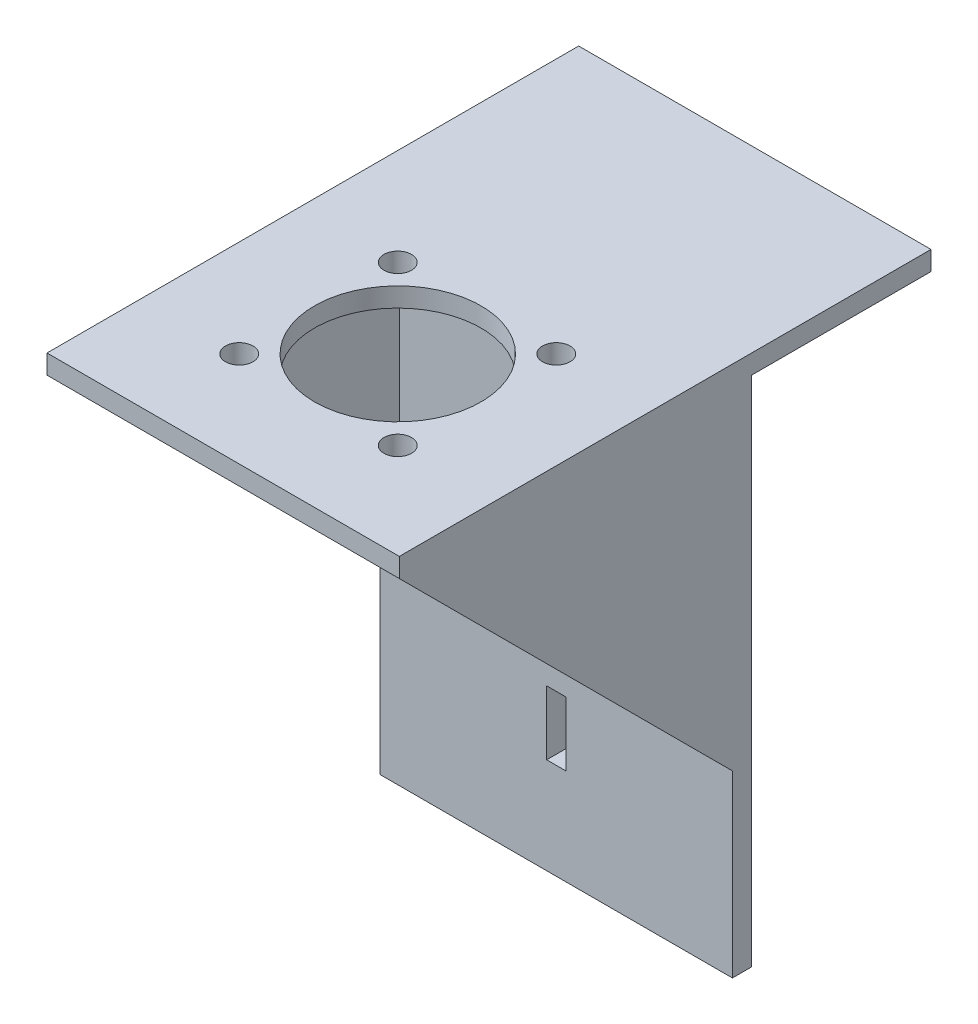
ISO-10303-21;
HEADER;
FILE_DESCRIPTION(('STEP AP214'),'2;1');
FILE_NAME('part.step','',(''),(''),'','','');
FILE_SCHEMA(('AUTOMOTIVE_DESIGN { 1 0 10303 214 1 1 1 1 }'));
ENDSEC;
DATA;
#1=APPLICATION_CONTEXT('core data for automotive mechanical design processes');
#2=APPLICATION_PROTOCOL_DEFINITION('international standard','automotive_design',2000,#1);
#3=PRODUCT_CONTEXT('',#1,'mechanical');
#4=PRODUCT('Part','Part','',(#3));
#5=PRODUCT_RELATED_PRODUCT_CATEGORY('part','',(#4));
#6=PRODUCT_DEFINITION_FORMATION('','',#4);
#7=PRODUCT_DEFINITION_CONTEXT('part definition',#1,'design');
#8=PRODUCT_DEFINITION('design','',#6,#7);
#9=PRODUCT_DEFINITION_SHAPE('','',#8);
#10=(LENGTH_UNIT() NAMED_UNIT(*) SI_UNIT(.MILLI.,.METRE.));
#11=(NAMED_UNIT(*) PLANE_ANGLE_UNIT() SI_UNIT($,.RADIAN.));
#12=(NAMED_UNIT(*) SI_UNIT($,.STERADIAN.) SOLID_ANGLE_UNIT());
#13=UNCERTAINTY_MEASURE_WITH_UNIT(LENGTH_MEASURE(1.E-05),#10,'distance_accuracy_value','');
#14=(GEOMETRIC_REPRESENTATION_CONTEXT(3) GLOBAL_UNCERTAINTY_ASSIGNED_CONTEXT((#13)) GLOBAL_UNIT_ASSIGNED_CONTEXT((#10,
#11,#12)) REPRESENTATION_CONTEXT('',''));
#15=CARTESIAN_POINT('',(0.,0.,0.));
#16=DIRECTION('',(0.,0.,1.));
#17=DIRECTION('',(1.,0.,0.));
#18=AXIS2_PLACEMENT_3D('',#15,#16,#17);
#19=CARTESIAN_POINT('',(-27.5,3.,-40.));
#20=DIRECTION('',(1.,0.,0.));
#21=DIRECTION('',(0.,0.,-1.));
#22=AXIS2_PLACEMENT_3D('',#19,#20,#21);
#23=PLANE('',#22);
#24=DIRECTION('',(0.,0.707106781186548,0.707106781186548));
#25=VECTOR('',#24,1.);
#26=CARTESIAN_POINT('',(-27.5,0.,40.));
#27=LINE('',#26,#25);
#28=CARTESIAN_POINT('',(-27.5,-52.,-12.));
#29=VERTEX_POINT('',#28);
#30=CARTESIAN_POINT('',(-27.5,0.,40.));
#31=VERTEX_POINT('',#30);
#32=EDGE_CURVE('E147',#29,#31,#27,.T.);
#33=ORIENTED_EDGE('',*,*,#32,.T.);
#34=DIRECTION('',(0.,-1.,0.));
#35=VECTOR('',#34,1.);
#36=CARTESIAN_POINT('',(-27.5,3.,40.));
#37=LINE('',#36,#35);
#38=CARTESIAN_POINT('',(-27.5,3.,40.));
#39=VERTEX_POINT('',#38);
#40=EDGE_CURVE('E252',#39,#31,#37,.T.);
#41=ORIENTED_EDGE('',*,*,#40,.F.);
#42=DIRECTION('',(0.,0.,1.));
#43=VECTOR('',#42,1.);
#44=CARTESIAN_POINT('',(-27.5,3.,-40.));
#45=LINE('',#44,#43);
#46=CARTESIAN_POINT('',(-27.5,3.,-43.));
#47=VERTEX_POINT('',#46);
#48=EDGE_CURVE('E322',#47,#39,#45,.T.);
#49=ORIENTED_EDGE('',*,*,#48,.F.);
#50=DIRECTION('',(0.,1.,0.));
#51=VECTOR('',#50,1.);
#52=CARTESIAN_POINT('',(-27.5,3.,-43.));
#53=LINE('',#52,#51);
#54=CARTESIAN_POINT('',(-27.5,0.,-43.));
#55=VERTEX_POINT('',#54);
#56=EDGE_CURVE('E184',#55,#47,#53,.T.);
#57=ORIENTED_EDGE('',*,*,#56,.F.);
#58=DIRECTION('',(0.,0.,1.));
#59=VECTOR('',#58,1.);
#60=CARTESIAN_POINT('',(-27.5,0.,-40.));
#61=LINE('',#60,#59);
#62=CARTESIAN_POINT('',(-27.5,0.,-15.));
#63=VERTEX_POINT('',#62);
#64=EDGE_CURVE('E313',#55,#63,#61,.T.);
#65=ORIENTED_EDGE('',*,*,#64,.T.);
#66=DIRECTION('',(0.,1.,0.));
#67=VECTOR('',#66,1.);
#68=CARTESIAN_POINT('',(-27.5,-80.,-15.));
#69=LINE('',#68,#67);
#70=CARTESIAN_POINT('',(-27.5,-80.,-15.));
#71=VERTEX_POINT('',#70);
#72=EDGE_CURVE('E233',#71,#63,#69,.T.);
#73=ORIENTED_EDGE('',*,*,#72,.F.);
#74=DIRECTION('',(0.,0.,-1.));
#75=VECTOR('',#74,1.);
#76=CARTESIAN_POINT('',(-27.5,-80.,-15.));
#77=LINE('',#76,#75);
#78=CARTESIAN_POINT('',(-27.5,-80.,-12.));
#79=VERTEX_POINT('',#78);
#80=EDGE_CURVE('E210',#79,#71,#77,.T.);
#81=ORIENTED_EDGE('',*,*,#80,.F.);
#82=DIRECTION('',(0.,1.,0.));
#83=VECTOR('',#82,1.);
#84=CARTESIAN_POINT('',(-27.5,-80.,-12.));
#85=LINE('',#84,#83);
#86=EDGE_CURVE('E219',#79,#29,#85,.T.);
#87=ORIENTED_EDGE('',*,*,#86,.T.);
#88=EDGE_LOOP('',(#33,#41,#49,#57,#65,#73,#81,#87));
#89=FACE_BOUND('',#88,.T.);
#90=ADVANCED_FACE('F33',(#89),#23,.F.);
#91=CARTESIAN_POINT('',(27.5,3.,-40.));
#92=DIRECTION('',(-1.,0.,0.));
#93=DIRECTION('',(0.,0.,1.));
#94=AXIS2_PLACEMENT_3D('',#91,#92,#93);
#95=PLANE('',#94);
#96=DIRECTION('',(0.,0.,-1.));
#97=VECTOR('',#96,1.);
#98=CARTESIAN_POINT('',(27.5,0.,-40.));
#99=LINE('',#98,#97);
#100=CARTESIAN_POINT('',(27.5,0.,-15.));
#101=VERTEX_POINT('',#100);
#102=CARTESIAN_POINT('',(27.5,0.,-43.));
#103=VERTEX_POINT('',#102);
#104=EDGE_CURVE('E227',#101,#103,#99,.T.);
#105=ORIENTED_EDGE('',*,*,#104,.T.);
#106=DIRECTION('',(0.,-1.,0.));
#107=VECTOR('',#106,1.);
#108=CARTESIAN_POINT('',(27.5,3.,-43.));
#109=LINE('',#108,#107);
#110=CARTESIAN_POINT('',(27.5,3.,-43.));
#111=VERTEX_POINT('',#110);
#112=EDGE_CURVE('E181',#111,#103,#109,.T.);
#113=ORIENTED_EDGE('',*,*,#112,.F.);
#114=DIRECTION('',(0.,0.,-1.));
#115=VECTOR('',#114,1.);
#116=CARTESIAN_POINT('',(27.5,3.,-40.));
#117=LINE('',#116,#115);
#118=CARTESIAN_POINT('',(27.5,3.,40.));
#119=VERTEX_POINT('',#118);
#120=EDGE_CURVE('E311',#119,#111,#117,.T.);
#121=ORIENTED_EDGE('',*,*,#120,.F.);
#122=DIRECTION('',(0.,-1.,0.));
#123=VECTOR('',#122,1.);
#124=CARTESIAN_POINT('',(27.5,3.,40.));
#125=LINE('',#124,#123);
#126=CARTESIAN_POINT('',(27.5,0.,40.));
#127=VERTEX_POINT('',#126);
#128=EDGE_CURVE('E308',#119,#127,#125,.T.);
#129=ORIENTED_EDGE('',*,*,#128,.T.);
#130=DIRECTION('',(0.,-0.707106781186548,-0.707106781186548));
#131=VECTOR('',#130,1.);
#132=CARTESIAN_POINT('',(27.5,-52.,-12.));
#133=LINE('',#132,#131);
#134=CARTESIAN_POINT('',(27.5,-52.,-12.));
#135=VERTEX_POINT('',#134);
#136=EDGE_CURVE('E151',#127,#135,#133,.T.);
#137=ORIENTED_EDGE('',*,*,#136,.T.);
#138=DIRECTION('',(0.,1.,0.));
#139=VECTOR('',#138,1.);
#140=CARTESIAN_POINT('',(27.5,-80.,-12.));
#141=LINE('',#140,#139);
#142=CARTESIAN_POINT('',(27.5,-80.,-12.));
#143=VERTEX_POINT('',#142);
#144=EDGE_CURVE('E234',#143,#135,#141,.T.);
#145=ORIENTED_EDGE('',*,*,#144,.F.);
#146=DIRECTION('',(0.,0.,1.));
#147=VECTOR('',#146,1.);
#148=CARTESIAN_POINT('',(27.5,-80.,-15.));
#149=LINE('',#148,#147);
#150=CARTESIAN_POINT('',(27.5,-80.,-15.));
#151=VERTEX_POINT('',#150);
#152=EDGE_CURVE('E215',#151,#143,#149,.T.);
#153=ORIENTED_EDGE('',*,*,#152,.F.);
#154=DIRECTION('',(0.,1.,0.));
#155=VECTOR('',#154,1.);
#156=CARTESIAN_POINT('',(27.5,-80.,-15.));
#157=LINE('',#156,#155);
#158=EDGE_CURVE('E230',#151,#101,#157,.T.);
#159=ORIENTED_EDGE('',*,*,#158,.T.);
#160=EDGE_LOOP('',(#105,#113,#121,#129,#137,#145,#153,#159));
#161=FACE_BOUND('',#160,.T.);
#162=ADVANCED_FACE('F290',(#161),#95,.F.);
#163=CARTESIAN_POINT('',(0.,0.,-43.));
#164=DIRECTION('',(0.,0.,-1.));
#165=DIRECTION('',(-1.,0.,0.));
#166=AXIS2_PLACEMENT_3D('',#163,#164,#165);
#167=PLANE('',#166);
#168=ORIENTED_EDGE('',*,*,#112,.T.);
#169=DIRECTION('',(1.,0.,0.));
#170=VECTOR('',#169,1.);
#171=CARTESIAN_POINT('',(27.5,0.,-43.));
#172=LINE('',#171,#170);
#173=EDGE_CURVE('E177',#55,#103,#172,.T.);
#174=ORIENTED_EDGE('',*,*,#173,.F.);
#175=ORIENTED_EDGE('',*,*,#56,.T.);
#176=DIRECTION('',(1.,0.,0.));
#177=VECTOR('',#176,1.);
#178=CARTESIAN_POINT('',(27.5,3.,-43.));
#179=LINE('',#178,#177);
#180=EDGE_CURVE('E186',#47,#111,#179,.T.);
#181=ORIENTED_EDGE('',*,*,#180,.T.);
#182=EDGE_LOOP('',(#168,#174,#175,#181));
#183=FACE_BOUND('',#182,.T.);
#184=ADVANCED_FACE('F296',(#183),#167,.T.);
#185=CARTESIAN_POINT('',(0.,0.,0.));
#186=DIRECTION('',(0.,1.,0.));
#187=DIRECTION('',(0.,0.,1.));
#188=AXIS2_PLACEMENT_3D('',#185,#186,#187);
#189=PLANE('',#188);
#190=CARTESIAN_POINT('',(-12.3743686707644,0.,0.369562995436836));
#191=DIRECTION('',(0.,1.,0.));
#192=DIRECTION('',(0.,0.,1.));
#193=AXIS2_PLACEMENT_3D('',#190,#191,#192);
#194=CIRCLE('',#193,2.15);
#195=CARTESIAN_POINT('',(-12.3743686707644,0.,2.51956299543684));
#196=VERTEX_POINT('',#195);
#197=EDGE_CURVE('E239',#196,#196,#194,.T.);
#198=ORIENTED_EDGE('',*,*,#197,.T.);
#199=EDGE_LOOP('',(#198));
#200=FACE_BOUND('',#199,.T.);
#201=CARTESIAN_POINT('',(12.3743686707652,0.,25.1183003369655));
#202=DIRECTION('',(0.,1.,0.));
#203=DIRECTION('',(0.,0.,1.));
#204=AXIS2_PLACEMENT_3D('',#201,#202,#203);
#205=CIRCLE('',#204,2.15);
#206=CARTESIAN_POINT('',(12.3743686707652,0.,27.2683003369655));
#207=VERTEX_POINT('',#206);
#208=EDGE_CURVE('E340',#207,#207,#205,.T.);
#209=ORIENTED_EDGE('',*,*,#208,.T.);
#210=EDGE_LOOP('',(#209));
#211=FACE_BOUND('',#210,.T.);
#212=CARTESIAN_POINT('',(0.,0.,12.7439316662008));
#213=DIRECTION('',(0.,1.,0.));
#214=DIRECTION('',(0.,0.,1.));
#215=AXIS2_PLACEMENT_3D('',#212,#213,#214);
#216=CIRCLE('',#215,13.);
#217=CARTESIAN_POINT('',(0.,0.,25.7439316662008));
#218=VERTEX_POINT('',#217);
#219=EDGE_CURVE('E328',#218,#218,#216,.T.);
#220=ORIENTED_EDGE('',*,*,#219,.T.);
#221=EDGE_LOOP('',(#220));
#222=FACE_BOUND('',#221,.T.);
#223=CARTESIAN_POINT('',(12.3743686707646,0.,0.369562995436263));
#224=DIRECTION('',(0.,1.,0.));
#225=DIRECTION('',(0.,0.,1.));
#226=AXIS2_PLACEMENT_3D('',#223,#224,#225);
#227=CIRCLE('',#226,2.15);
#228=CARTESIAN_POINT('',(12.3743686707646,0.,2.51956299543626));
#229=VERTEX_POINT('',#228);
#230=EDGE_CURVE('E334',#229,#229,#227,.T.);
#231=ORIENTED_EDGE('',*,*,#230,.T.);
#232=EDGE_LOOP('',(#231));
#233=FACE_BOUND('',#232,.T.);
#234=CARTESIAN_POINT('',(-12.374368670764,0.,25.118300336966));
#235=DIRECTION('',(0.,1.,0.));
#236=DIRECTION('',(0.,0.,1.));
#237=AXIS2_PLACEMENT_3D('',#234,#235,#236);
#238=CIRCLE('',#237,2.15);
#239=CARTESIAN_POINT('',(-12.374368670764,0.,27.268300336966));
#240=VERTEX_POINT('',#239);
#241=EDGE_CURVE('E346',#240,#240,#238,.T.);
#242=ORIENTED_EDGE('',*,*,#241,.T.);
#243=EDGE_LOOP('',(#242));
#244=FACE_BOUND('',#243,.T.);
#245=DIRECTION('',(1.,0.,0.));
#246=VECTOR('',#245,1.);
#247=CARTESIAN_POINT('',(-27.5,0.,40.));
#248=LINE('',#247,#246);
#249=CARTESIAN_POINT('',(-24.5,0.,40.));
#250=VERTEX_POINT('',#249);
#251=CARTESIAN_POINT('',(24.5,0.,40.));
#252=VERTEX_POINT('',#251);
#253=EDGE_CURVE('E49',#250,#252,#248,.T.);
#254=ORIENTED_EDGE('',*,*,#253,.F.);
#255=DIRECTION('',(0.,0.,-1.));
#256=VECTOR('',#255,1.);
#257=CARTESIAN_POINT('',(-24.5,0.,-12.));
#258=LINE('',#257,#256);
#259=CARTESIAN_POINT('',(-24.5,0.,-12.));
#260=VERTEX_POINT('',#259);
#261=EDGE_CURVE('E152',#250,#260,#258,.T.);
#262=ORIENTED_EDGE('',*,*,#261,.T.);
#263=DIRECTION('',(-1.,0.,0.));
#264=VECTOR('',#263,1.);
#265=CARTESIAN_POINT('',(-27.5,0.,-12.));
#266=LINE('',#265,#264);
#267=CARTESIAN_POINT('',(24.5,0.,-12.));
#268=VERTEX_POINT('',#267);
#269=EDGE_CURVE('E36',#268,#260,#266,.T.);
#270=ORIENTED_EDGE('',*,*,#269,.F.);
#271=DIRECTION('',(0.,0.,1.));
#272=VECTOR('',#271,1.);
#273=CARTESIAN_POINT('',(24.5,0.,40.));
#274=LINE('',#273,#272);
#275=EDGE_CURVE('E171',#268,#252,#274,.T.);
#276=ORIENTED_EDGE('',*,*,#275,.T.);
#277=EDGE_LOOP('',(#254,#262,#270,#276));
#278=FACE_BOUND('',#277,.T.);
#279=ADVANCED_FACE('F370',(#200,#211,#222,#233,#244,#278),#189,.F.);
#280=DIRECTION('',(1.,0.,0.));
#281=VECTOR('',#280,1.);
#282=CARTESIAN_POINT('',(-27.5,0.,-15.));
#283=LINE('',#282,#281);
#284=EDGE_CURVE('E203',#63,#101,#283,.T.);
#285=ORIENTED_EDGE('',*,*,#284,.F.);
#286=ORIENTED_EDGE('',*,*,#64,.F.);
#287=ORIENTED_EDGE('',*,*,#173,.T.);
#288=ORIENTED_EDGE('',*,*,#104,.F.);
#289=EDGE_LOOP('',(#285,#286,#287,#288));
#290=FACE_BOUND('',#289,.T.);
#291=ADVANCED_FACE('F361',(#290),#189,.F.);
#292=CARTESIAN_POINT('',(0.,3.,0.));
#293=DIRECTION('',(0.,1.,0.));
#294=DIRECTION('',(0.,0.,1.));
#295=AXIS2_PLACEMENT_3D('',#292,#293,#294);
#296=PLANE('',#295);
#297=CARTESIAN_POINT('',(-12.374368670764,3.,25.118300336966));
#298=DIRECTION('',(0.,1.,0.));
#299=DIRECTION('',(0.,0.,1.));
#300=AXIS2_PLACEMENT_3D('',#297,#298,#299);
#301=CIRCLE('',#300,2.15);
#302=CARTESIAN_POINT('',(-12.374368670764,3.,27.268300336966));
#303=VERTEX_POINT('',#302);
#304=EDGE_CURVE('E343',#303,#303,#301,.T.);
#305=ORIENTED_EDGE('',*,*,#304,.F.);
#306=EDGE_LOOP('',(#305));
#307=FACE_BOUND('',#306,.T.);
#308=CARTESIAN_POINT('',(12.3743686707646,3.,0.369562995436263));
#309=DIRECTION('',(0.,1.,0.));
#310=DIRECTION('',(0.,0.,1.));
#311=AXIS2_PLACEMENT_3D('',#308,#309,#310);
#312=CIRCLE('',#311,2.15);
#313=CARTESIAN_POINT('',(12.3743686707646,3.,2.51956299543626));
#314=VERTEX_POINT('',#313);
#315=EDGE_CURVE('E331',#314,#314,#312,.T.);
#316=ORIENTED_EDGE('',*,*,#315,.F.);
#317=EDGE_LOOP('',(#316));
#318=FACE_BOUND('',#317,.T.);
#319=ORIENTED_EDGE('',*,*,#48,.T.);
#320=DIRECTION('',(1.,0.,0.));
#321=VECTOR('',#320,1.);
#322=CARTESIAN_POINT('',(-27.5,3.,40.));
#323=LINE('',#322,#321);
#324=EDGE_CURVE('E306',#39,#119,#323,.T.);
#325=ORIENTED_EDGE('',*,*,#324,.T.);
#326=ORIENTED_EDGE('',*,*,#120,.T.);
#327=ORIENTED_EDGE('',*,*,#180,.F.);
#328=EDGE_LOOP('',(#319,#325,#326,#327));
#329=FACE_BOUND('',#328,.T.);
#330=CARTESIAN_POINT('',(0.,3.,12.7439316662008));
#331=DIRECTION('',(0.,1.,0.));
#332=DIRECTION('',(0.,0.,1.));
#333=AXIS2_PLACEMENT_3D('',#330,#331,#332);
#334=CIRCLE('',#333,13.);
#335=CARTESIAN_POINT('',(0.,3.,25.7439316662008));
#336=VERTEX_POINT('',#335);
#337=EDGE_CURVE('E316',#336,#336,#334,.T.);
#338=ORIENTED_EDGE('',*,*,#337,.F.);
#339=EDGE_LOOP('',(#338));
#340=FACE_BOUND('',#339,.T.);
#341=CARTESIAN_POINT('',(12.3743686707652,3.,25.1183003369655));
#342=DIRECTION('',(0.,1.,0.));
#343=DIRECTION('',(0.,0.,1.));
#344=AXIS2_PLACEMENT_3D('',#341,#342,#343);
#345=CIRCLE('',#344,2.15);
#346=CARTESIAN_POINT('',(12.3743686707652,3.,27.2683003369655));
#347=VERTEX_POINT('',#346);
#348=EDGE_CURVE('E337',#347,#347,#345,.T.);
#349=ORIENTED_EDGE('',*,*,#348,.F.);
#350=EDGE_LOOP('',(#349));
#351=FACE_BOUND('',#350,.T.);
#352=CARTESIAN_POINT('',(-12.3743686707644,3.,0.369562995436836));
#353=DIRECTION('',(0.,1.,0.));
#354=DIRECTION('',(0.,0.,1.));
#355=AXIS2_PLACEMENT_3D('',#352,#353,#354);
#356=CIRCLE('',#355,2.15);
#357=CARTESIAN_POINT('',(-12.3743686707644,3.,2.51956299543684));
#358=VERTEX_POINT('',#357);
#359=EDGE_CURVE('E349',#358,#358,#356,.T.);
#360=ORIENTED_EDGE('',*,*,#359,.F.);
#361=EDGE_LOOP('',(#360));
#362=FACE_BOUND('',#361,.T.);
#363=ADVANCED_FACE('F359',(#307,#318,#329,#340,#351,#362),#296,.T.);
#364=CARTESIAN_POINT('',(-27.5,3.,40.));
#365=DIRECTION('',(0.,0.,-1.));
#366=DIRECTION('',(-1.,0.,0.));
#367=AXIS2_PLACEMENT_3D('',#364,#365,#366);
#368=PLANE('',#367);
#369=EDGE_CURVE('E304',#31,#250,#248,.T.);
#370=ORIENTED_EDGE('',*,*,#369,.T.);
#371=ORIENTED_EDGE('',*,*,#253,.T.);
#372=DIRECTION('',(1.,0.,0.));
#373=VECTOR('',#372,1.);
#374=CARTESIAN_POINT('',(24.5,0.,40.));
#375=LINE('',#374,#373);
#376=EDGE_CURVE('E175',#252,#127,#375,.T.);
#377=ORIENTED_EDGE('',*,*,#376,.T.);
#378=ORIENTED_EDGE('',*,*,#128,.F.);
#379=ORIENTED_EDGE('',*,*,#324,.F.);
#380=ORIENTED_EDGE('',*,*,#40,.T.);
#381=EDGE_LOOP('',(#370,#371,#377,#378,#379,#380));
#382=FACE_BOUND('',#381,.T.);
#383=ADVANCED_FACE('F303',(#382),#368,.F.);
#384=CARTESIAN_POINT('',(0.,3.,12.7439316662008));
#385=DIRECTION('',(0.,-1.,0.));
#386=DIRECTION('',(0.,0.,-1.));
#387=AXIS2_PLACEMENT_3D('',#384,#385,#386);
#388=CYLINDRICAL_SURFACE('',#387,13.);
#389=ORIENTED_EDGE('',*,*,#337,.T.);
#390=EDGE_LOOP('',(#389));
#391=FACE_BOUND('',#390,.T.);
#392=ORIENTED_EDGE('',*,*,#219,.F.);
#393=EDGE_LOOP('',(#392));
#394=FACE_BOUND('',#393,.T.);
#395=ADVANCED_FACE('F369',(#391,#394),#388,.F.);
#396=CARTESIAN_POINT('',(12.3743686707646,3.,0.369562995436263));
#397=DIRECTION('',(0.,-1.,0.));
#398=DIRECTION('',(0.,0.,-1.));
#399=AXIS2_PLACEMENT_3D('',#396,#397,#398);
#400=CYLINDRICAL_SURFACE('',#399,2.15);
#401=ORIENTED_EDGE('',*,*,#315,.T.);
#402=EDGE_LOOP('',(#401));
#403=FACE_BOUND('',#402,.T.);
#404=ORIENTED_EDGE('',*,*,#230,.F.);
#405=EDGE_LOOP('',(#404));
#406=FACE_BOUND('',#405,.T.);
#407=ADVANCED_FACE('F429',(#403,#406),#400,.F.);
#408=CARTESIAN_POINT('',(12.3743686707652,3.,25.1183003369655));
#409=DIRECTION('',(0.,-1.,0.));
#410=DIRECTION('',(0.,0.,-1.));
#411=AXIS2_PLACEMENT_3D('',#408,#409,#410);
#412=CYLINDRICAL_SURFACE('',#411,2.15);
#413=ORIENTED_EDGE('',*,*,#348,.T.);
#414=EDGE_LOOP('',(#413));
#415=FACE_BOUND('',#414,.T.);
#416=ORIENTED_EDGE('',*,*,#208,.F.);
#417=EDGE_LOOP('',(#416));
#418=FACE_BOUND('',#417,.T.);
#419=ADVANCED_FACE('F426',(#415,#418),#412,.F.);
#420=CARTESIAN_POINT('',(-12.374368670764,3.,25.118300336966));
#421=DIRECTION('',(0.,-1.,0.));
#422=DIRECTION('',(0.,0.,-1.));
#423=AXIS2_PLACEMENT_3D('',#420,#421,#422);
#424=CYLINDRICAL_SURFACE('',#423,2.15);
#425=ORIENTED_EDGE('',*,*,#304,.T.);
#426=EDGE_LOOP('',(#425));
#427=FACE_BOUND('',#426,.T.);
#428=ORIENTED_EDGE('',*,*,#241,.F.);
#429=EDGE_LOOP('',(#428));
#430=FACE_BOUND('',#429,.T.);
#431=ADVANCED_FACE('F423',(#427,#430),#424,.F.);
#432=CARTESIAN_POINT('',(-12.3743686707644,3.,0.369562995436836));
#433=DIRECTION('',(0.,-1.,0.));
#434=DIRECTION('',(0.,0.,-1.));
#435=AXIS2_PLACEMENT_3D('',#432,#433,#434);
#436=CYLINDRICAL_SURFACE('',#435,2.15);
#437=ORIENTED_EDGE('',*,*,#359,.T.);
#438=EDGE_LOOP('',(#437));
#439=FACE_BOUND('',#438,.T.);
#440=ORIENTED_EDGE('',*,*,#197,.F.);
#441=EDGE_LOOP('',(#440));
#442=FACE_BOUND('',#441,.T.);
#443=ADVANCED_FACE('F356',(#439,#442),#436,.F.);
#444=CARTESIAN_POINT('',(-27.5,-80.,-15.));
#445=DIRECTION('',(0.,0.,1.));
#446=DIRECTION('',(1.,0.,0.));
#447=AXIS2_PLACEMENT_3D('',#444,#445,#446);
#448=PLANE('',#447);
#449=DIRECTION('',(-1.,0.,0.));
#450=VECTOR('',#449,1.);
#451=CARTESIAN_POINT('',(1.50000000000001,-65.,-15.));
#452=LINE('',#451,#450);
#453=CARTESIAN_POINT('',(1.50000000000001,-65.,-15.));
#454=VERTEX_POINT('',#453);
#455=CARTESIAN_POINT('',(-1.49999999999999,-65.,-15.));
#456=VERTEX_POINT('',#455);
#457=EDGE_CURVE('E191',#454,#456,#452,.T.);
#458=ORIENTED_EDGE('',*,*,#457,.F.);
#459=DIRECTION('',(0.,-1.,0.));
#460=VECTOR('',#459,1.);
#461=CARTESIAN_POINT('',(1.50000000000001,-55.,-15.));
#462=LINE('',#461,#460);
#463=CARTESIAN_POINT('',(1.50000000000001,-55.,-15.));
#464=VERTEX_POINT('',#463);
#465=EDGE_CURVE('E189',#464,#454,#462,.T.);
#466=ORIENTED_EDGE('',*,*,#465,.F.);
#467=DIRECTION('',(1.,0.,0.));
#468=VECTOR('',#467,1.);
#469=CARTESIAN_POINT('',(1.50000000000001,-55.,-15.));
#470=LINE('',#469,#468);
#471=CARTESIAN_POINT('',(-1.49999999999999,-55.,-15.));
#472=VERTEX_POINT('',#471);
#473=EDGE_CURVE('E197',#472,#464,#470,.T.);
#474=ORIENTED_EDGE('',*,*,#473,.F.);
#475=DIRECTION('',(0.,1.,0.));
#476=VECTOR('',#475,1.);
#477=CARTESIAN_POINT('',(-1.49999999999999,-55.,-15.));
#478=LINE('',#477,#476);
#479=EDGE_CURVE('E194',#456,#472,#478,.T.);
#480=ORIENTED_EDGE('',*,*,#479,.F.);
#481=EDGE_LOOP('',(#458,#466,#474,#480));
#482=FACE_BOUND('',#481,.T.);
#483=ORIENTED_EDGE('',*,*,#284,.T.);
#484=ORIENTED_EDGE('',*,*,#158,.F.);
#485=DIRECTION('',(1.,0.,0.));
#486=VECTOR('',#485,1.);
#487=CARTESIAN_POINT('',(-27.5,-80.,-15.));
#488=LINE('',#487,#486);
#489=EDGE_CURVE('E213',#71,#151,#488,.T.);
#490=ORIENTED_EDGE('',*,*,#489,.F.);
#491=ORIENTED_EDGE('',*,*,#72,.T.);
#492=EDGE_LOOP('',(#483,#484,#490,#491));
#493=FACE_BOUND('',#492,.T.);
#494=ADVANCED_FACE('F269',(#482,#493),#448,.F.);
#495=CARTESIAN_POINT('',(-27.5,-80.,-12.));
#496=DIRECTION('',(0.,0.,-1.));
#497=DIRECTION('',(-1.,0.,0.));
#498=AXIS2_PLACEMENT_3D('',#495,#496,#497);
#499=PLANE('',#498);
#500=DIRECTION('',(1.,0.,0.));
#501=VECTOR('',#500,1.);
#502=CARTESIAN_POINT('',(-27.5,-55.,-12.));
#503=LINE('',#502,#501);
#504=CARTESIAN_POINT('',(-1.49999999999999,-55.,-12.));
#505=VERTEX_POINT('',#504);
#506=CARTESIAN_POINT('',(1.50000000000001,-55.,-12.));
#507=VERTEX_POINT('',#506);
#508=EDGE_CURVE('E42',#505,#507,#503,.T.);
#509=ORIENTED_EDGE('',*,*,#508,.T.);
#510=DIRECTION('',(0.,-1.,0.));
#511=VECTOR('',#510,1.);
#512=CARTESIAN_POINT('',(1.50000000000001,-80.,-12.));
#513=LINE('',#512,#511);
#514=CARTESIAN_POINT('',(1.50000000000001,-65.,-12.));
#515=VERTEX_POINT('',#514);
#516=EDGE_CURVE('E11',#507,#515,#513,.T.);
#517=ORIENTED_EDGE('',*,*,#516,.T.);
#518=DIRECTION('',(-1.,0.,0.));
#519=VECTOR('',#518,1.);
#520=CARTESIAN_POINT('',(-27.5,-65.,-12.));
#521=LINE('',#520,#519);
#522=CARTESIAN_POINT('',(-1.49999999999999,-65.,-12.));
#523=VERTEX_POINT('',#522);
#524=EDGE_CURVE('E248',#515,#523,#521,.T.);
#525=ORIENTED_EDGE('',*,*,#524,.T.);
#526=DIRECTION('',(0.,1.,0.));
#527=VECTOR('',#526,1.);
#528=CARTESIAN_POINT('',(-1.5,-80.,-12.));
#529=LINE('',#528,#527);
#530=EDGE_CURVE('E251',#523,#505,#529,.T.);
#531=ORIENTED_EDGE('',*,*,#530,.T.);
#532=EDGE_LOOP('',(#509,#517,#525,#531));
#533=FACE_BOUND('',#532,.T.);
#534=DIRECTION('',(0.,-1.,0.));
#535=VECTOR('',#534,1.);
#536=CARTESIAN_POINT('',(-24.5,-52.,-12.));
#537=LINE('',#536,#535);
#538=CARTESIAN_POINT('',(-24.5,-52.,-12.));
#539=VERTEX_POINT('',#538);
#540=EDGE_CURVE('E156',#260,#539,#537,.T.);
#541=ORIENTED_EDGE('',*,*,#540,.T.);
#542=DIRECTION('',(-1.,0.,0.));
#543=VECTOR('',#542,1.);
#544=CARTESIAN_POINT('',(-24.5,-52.,-12.));
#545=LINE('',#544,#543);
#546=EDGE_CURVE('E141',#539,#29,#545,.T.);
#547=ORIENTED_EDGE('',*,*,#546,.T.);
#548=ORIENTED_EDGE('',*,*,#86,.F.);
#549=DIRECTION('',(-1.,0.,0.));
#550=VECTOR('',#549,1.);
#551=CARTESIAN_POINT('',(-27.5,-80.,-12.));
#552=LINE('',#551,#550);
#553=EDGE_CURVE('E217',#143,#79,#552,.T.);
#554=ORIENTED_EDGE('',*,*,#553,.F.);
#555=ORIENTED_EDGE('',*,*,#144,.T.);
#556=DIRECTION('',(1.,0.,0.));
#557=VECTOR('',#556,1.);
#558=CARTESIAN_POINT('',(24.5,-52.,-12.));
#559=LINE('',#558,#557);
#560=CARTESIAN_POINT('',(24.5,-52.,-12.));
#561=VERTEX_POINT('',#560);
#562=EDGE_CURVE('E57',#561,#135,#559,.T.);
#563=ORIENTED_EDGE('',*,*,#562,.F.);
#564=DIRECTION('',(0.,1.,0.));
#565=VECTOR('',#564,1.);
#566=CARTESIAN_POINT('',(24.5,0.,-12.));
#567=LINE('',#566,#565);
#568=EDGE_CURVE('E169',#561,#268,#567,.T.);
#569=ORIENTED_EDGE('',*,*,#568,.T.);
#570=ORIENTED_EDGE('',*,*,#269,.T.);
#571=EDGE_LOOP('',(#541,#547,#548,#554,#555,#563,#569,#570));
#572=FACE_BOUND('',#571,.T.);
#573=ADVANCED_FACE('F160',(#533,#572),#499,.F.);
#574=CARTESIAN_POINT('',(0.,-80.,0.));
#575=DIRECTION('',(0.,1.,0.));
#576=DIRECTION('',(0.,0.,1.));
#577=AXIS2_PLACEMENT_3D('',#574,#575,#576);
#578=PLANE('',#577);
#579=ORIENTED_EDGE('',*,*,#80,.T.);
#580=ORIENTED_EDGE('',*,*,#489,.T.);
#581=ORIENTED_EDGE('',*,*,#152,.T.);
#582=ORIENTED_EDGE('',*,*,#553,.T.);
#583=EDGE_LOOP('',(#579,#580,#581,#582));
#584=FACE_BOUND('',#583,.T.);
#585=ADVANCED_FACE('F410',(#584),#578,.F.);
#586=CARTESIAN_POINT('',(1.50000000000001,-55.,65.));
#587=DIRECTION('',(1.,0.,0.));
#588=DIRECTION('',(0.,0.,-1.));
#589=AXIS2_PLACEMENT_3D('',#586,#587,#588);
#590=PLANE('',#589);
#591=DIRECTION('',(0.,0.,-1.));
#592=VECTOR('',#591,1.);
#593=CARTESIAN_POINT('',(1.50000000000001,-55.,65.));
#594=LINE('',#593,#592);
#595=EDGE_CURVE('E201',#507,#464,#594,.T.);
#596=ORIENTED_EDGE('',*,*,#595,.T.);
#597=ORIENTED_EDGE('',*,*,#465,.T.);
#598=DIRECTION('',(0.,0.,-1.));
#599=VECTOR('',#598,1.);
#600=CARTESIAN_POINT('',(1.50000000000001,-65.,65.));
#601=LINE('',#600,#599);
#602=EDGE_CURVE('E200',#515,#454,#601,.T.);
#603=ORIENTED_EDGE('',*,*,#602,.F.);
#604=ORIENTED_EDGE('',*,*,#516,.F.);
#605=EDGE_LOOP('',(#596,#597,#603,#604));
#606=FACE_BOUND('',#605,.T.);
#607=ADVANCED_FACE('F273',(#606),#590,.F.);
#608=CARTESIAN_POINT('',(1.50000000000001,-55.,65.));
#609=DIRECTION('',(0.,1.,0.));
#610=DIRECTION('',(0.,0.,1.));
#611=AXIS2_PLACEMENT_3D('',#608,#609,#610);
#612=PLANE('',#611);
#613=DIRECTION('',(0.,0.,-1.));
#614=VECTOR('',#613,1.);
#615=CARTESIAN_POINT('',(-1.49999999999999,-55.,65.));
#616=LINE('',#615,#614);
#617=EDGE_CURVE('E204',#505,#472,#616,.T.);
#618=ORIENTED_EDGE('',*,*,#617,.T.);
#619=ORIENTED_EDGE('',*,*,#473,.T.);
#620=ORIENTED_EDGE('',*,*,#595,.F.);
#621=ORIENTED_EDGE('',*,*,#508,.F.);
#622=EDGE_LOOP('',(#618,#619,#620,#621));
#623=FACE_BOUND('',#622,.T.);
#624=ADVANCED_FACE('F261',(#623),#612,.F.);
#625=CARTESIAN_POINT('',(-1.49999999999999,-55.,65.));
#626=DIRECTION('',(-1.,0.,0.));
#627=DIRECTION('',(0.,-1.,0.));
#628=AXIS2_PLACEMENT_3D('',#625,#626,#627);
#629=PLANE('',#628);
#630=DIRECTION('',(0.,0.,-1.));
#631=VECTOR('',#630,1.);
#632=CARTESIAN_POINT('',(-1.49999999999999,-65.,65.));
#633=LINE('',#632,#631);
#634=EDGE_CURVE('E206',#523,#456,#633,.T.);
#635=ORIENTED_EDGE('',*,*,#634,.T.);
#636=ORIENTED_EDGE('',*,*,#479,.T.);
#637=ORIENTED_EDGE('',*,*,#617,.F.);
#638=ORIENTED_EDGE('',*,*,#530,.F.);
#639=EDGE_LOOP('',(#635,#636,#637,#638));
#640=FACE_BOUND('',#639,.T.);
#641=ADVANCED_FACE('F263',(#640),#629,.F.);
#642=CARTESIAN_POINT('',(1.50000000000001,-65.,65.));
#643=DIRECTION('',(0.,-1.,0.));
#644=DIRECTION('',(0.,0.,-1.));
#645=AXIS2_PLACEMENT_3D('',#642,#643,#644);
#646=PLANE('',#645);
#647=ORIENTED_EDGE('',*,*,#602,.T.);
#648=ORIENTED_EDGE('',*,*,#457,.T.);
#649=ORIENTED_EDGE('',*,*,#634,.F.);
#650=ORIENTED_EDGE('',*,*,#524,.F.);
#651=EDGE_LOOP('',(#647,#648,#649,#650));
#652=FACE_BOUND('',#651,.T.);
#653=ADVANCED_FACE('F275',(#652),#646,.F.);
#654=CARTESIAN_POINT('',(24.5,-52.,-12.));
#655=DIRECTION('',(0.,-0.707106781186548,0.707106781186547));
#656=DIRECTION('',(0.,-0.707106781186547,-0.707106781186548));
#657=AXIS2_PLACEMENT_3D('',#654,#655,#656);
#658=PLANE('',#657);
#659=ORIENTED_EDGE('',*,*,#136,.F.);
#660=ORIENTED_EDGE('',*,*,#376,.F.);
#661=DIRECTION('',(0.,-0.707106781186548,-0.707106781186548));
#662=VECTOR('',#661,1.);
#663=CARTESIAN_POINT('',(24.5,-52.,-12.));
#664=LINE('',#663,#662);
#665=EDGE_CURVE('E166',#252,#561,#664,.T.);
#666=ORIENTED_EDGE('',*,*,#665,.T.);
#667=ORIENTED_EDGE('',*,*,#562,.T.);
#668=EDGE_LOOP('',(#659,#660,#666,#667));
#669=FACE_BOUND('',#668,.T.);
#670=ADVANCED_FACE('F277',(#669),#658,.T.);
#671=CARTESIAN_POINT('',(24.5,0.,0.));
#672=DIRECTION('',(-1.,0.,0.));
#673=DIRECTION('',(0.,0.,1.));
#674=AXIS2_PLACEMENT_3D('',#671,#672,#673);
#675=PLANE('',#674);
#676=ORIENTED_EDGE('',*,*,#665,.F.);
#677=ORIENTED_EDGE('',*,*,#275,.F.);
#678=ORIENTED_EDGE('',*,*,#568,.F.);
#679=EDGE_LOOP('',(#676,#677,#678));
#680=FACE_BOUND('',#679,.T.);
#681=ADVANCED_FACE('F284',(#680),#675,.T.);
#682=CARTESIAN_POINT('',(-24.5,0.,40.));
#683=DIRECTION('',(0.,-0.707106781186547,0.707106781186547));
#684=DIRECTION('',(0.,-0.707106781186548,-0.707106781186548));
#685=AXIS2_PLACEMENT_3D('',#682,#683,#684);
#686=PLANE('',#685);
#687=ORIENTED_EDGE('',*,*,#32,.F.);
#688=ORIENTED_EDGE('',*,*,#546,.F.);
#689=DIRECTION('',(0.,0.707106781186548,0.707106781186548));
#690=VECTOR('',#689,1.);
#691=CARTESIAN_POINT('',(-24.5,0.,40.));
#692=LINE('',#691,#690);
#693=EDGE_CURVE('E144',#539,#250,#692,.T.);
#694=ORIENTED_EDGE('',*,*,#693,.T.);
#695=ORIENTED_EDGE('',*,*,#369,.F.);
#696=EDGE_LOOP('',(#687,#688,#694,#695));
#697=FACE_BOUND('',#696,.T.);
#698=ADVANCED_FACE('F143',(#697),#686,.T.);
#699=CARTESIAN_POINT('',(-24.5,0.,0.));
#700=DIRECTION('',(1.,0.,0.));
#701=DIRECTION('',(0.,0.,-1.));
#702=AXIS2_PLACEMENT_3D('',#699,#700,#701);
#703=PLANE('',#702);
#704=ORIENTED_EDGE('',*,*,#540,.F.);
#705=ORIENTED_EDGE('',*,*,#261,.F.);
#706=ORIENTED_EDGE('',*,*,#693,.F.);
#707=EDGE_LOOP('',(#704,#705,#706));
#708=FACE_BOUND('',#707,.T.);
#709=ADVANCED_FACE('F155',(#708),#703,.T.);
#710=CLOSED_SHELL('',(#90,#162,#184,#279,#291,#363,#383,#395,#407,#419,#431,#443,#494,#573,#585,
#607,#624,#641,#653,#670,#681,#698,#709));
#711=MANIFOLD_SOLID_BREP('B2',#710);
#712=ADVANCED_BREP_SHAPE_REPRESENTATION('',(#18,#711),#14);
#713=SHAPE_DEFINITION_REPRESENTATION(#9,#712);
ENDSEC;
END-ISO-10303-21;
